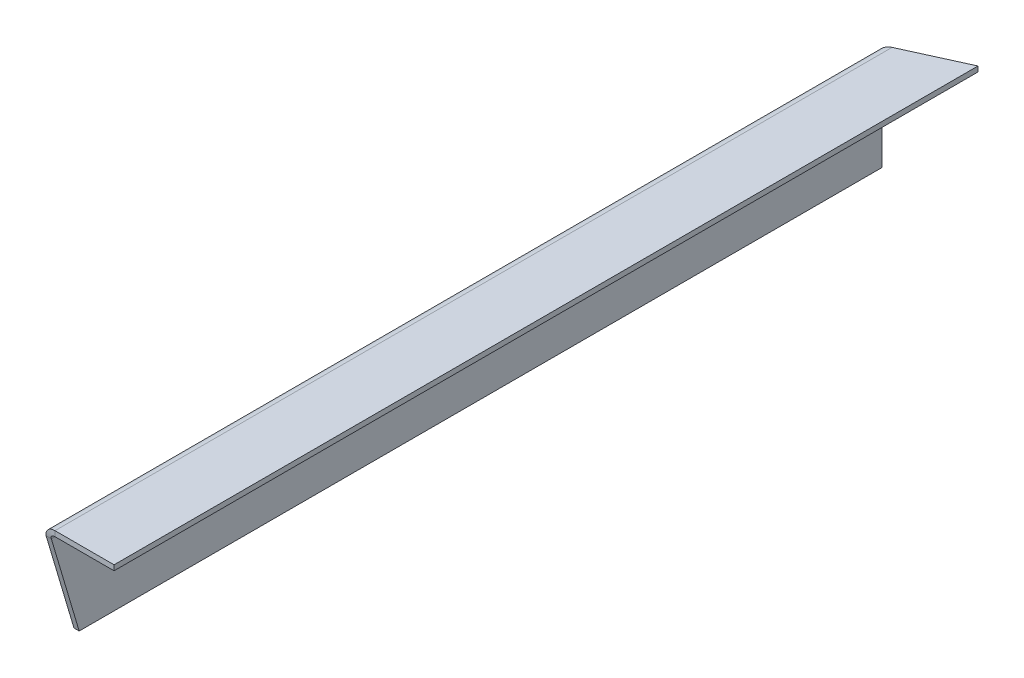
ISO-10303-21;
HEADER;
FILE_DESCRIPTION(('STEP AP214'),'2;1');
FILE_NAME('part.step','',(''),(''),'','','');
FILE_SCHEMA(('AUTOMOTIVE_DESIGN { 1 0 10303 214 1 1 1 1 }'));
ENDSEC;
DATA;
#1=APPLICATION_CONTEXT('core data for automotive mechanical design processes');
#2=APPLICATION_PROTOCOL_DEFINITION('international standard','automotive_design',2000,#1);
#3=PRODUCT_CONTEXT('',#1,'mechanical');
#4=PRODUCT('Part','Part','',(#3));
#5=PRODUCT_RELATED_PRODUCT_CATEGORY('part','',(#4));
#6=PRODUCT_DEFINITION_FORMATION('','',#4);
#7=PRODUCT_DEFINITION_CONTEXT('part definition',#1,'design');
#8=PRODUCT_DEFINITION('design','',#6,#7);
#9=PRODUCT_DEFINITION_SHAPE('','',#8);
#10=(LENGTH_UNIT() NAMED_UNIT(*) SI_UNIT(.MILLI.,.METRE.));
#11=(NAMED_UNIT(*) PLANE_ANGLE_UNIT() SI_UNIT($,.RADIAN.));
#12=(NAMED_UNIT(*) SI_UNIT($,.STERADIAN.) SOLID_ANGLE_UNIT());
#13=UNCERTAINTY_MEASURE_WITH_UNIT(LENGTH_MEASURE(1.E-05),#10,'distance_accuracy_value','');
#14=(GEOMETRIC_REPRESENTATION_CONTEXT(3) GLOBAL_UNCERTAINTY_ASSIGNED_CONTEXT((#13)) GLOBAL_UNIT_ASSIGNED_CONTEXT((#10,
#11,#12)) REPRESENTATION_CONTEXT('',''));
#15=CARTESIAN_POINT('',(0.,0.,0.));
#16=DIRECTION('',(0.,0.,1.));
#17=DIRECTION('',(1.,0.,0.));
#18=AXIS2_PLACEMENT_3D('',#15,#16,#17);
#19=CARTESIAN_POINT('',(0.,57.,436.000999999998));
#20=DIRECTION('',(0.,1.,0.));
#21=DIRECTION('',(0.,0.,1.));
#22=AXIS2_PLACEMENT_3D('',#19,#20,#21);
#23=PLANE('',#22);
#24=DIRECTION('',(-1.,0.,0.));
#25=VECTOR('',#24,1.);
#26=CARTESIAN_POINT('',(0.,57.,147.921874999998));
#27=LINE('',#26,#25);
#28=CARTESIAN_POINT('',(40.,57.,147.921874999998));
#29=VERTEX_POINT('',#28);
#30=CARTESIAN_POINT('',(6.,57.,147.921874999998));
#31=VERTEX_POINT('',#30);
#32=EDGE_CURVE('E196',#29,#31,#27,.T.);
#33=ORIENTED_EDGE('',*,*,#32,.T.);
#34=DIRECTION('',(0.,0.,-1.));
#35=VECTOR('',#34,1.);
#36=CARTESIAN_POINT('',(6.,57.,436.000999999998));
#37=LINE('',#36,#35);
#38=CARTESIAN_POINT('',(6.00000000000378,57.,-333.839611602809));
#39=VERTEX_POINT('',#38);
#40=EDGE_CURVE('E119',#31,#39,#37,.T.);
#41=ORIENTED_EDGE('',*,*,#40,.T.);
#42=CARTESIAN_POINT('',(7055.93060017359,57.,15135.4356956873));
#43=DIRECTION('',(0.,-1.,0.));
#44=DIRECTION('',(0.,0.,-1.));
#45=AXIS2_PLACEMENT_3D('',#42,#43,#44);
#46=CIRCLE('',#45,17000.);
#47=CARTESIAN_POINT('',(40.,57.,-349.289610676623));
#48=VERTEX_POINT('',#47);
#49=EDGE_CURVE('E135',#48,#39,#46,.F.);
#50=ORIENTED_EDGE('',*,*,#49,.F.);
#51=DIRECTION('',(0.,0.,-1.));
#52=VECTOR('',#51,1.);
#53=CARTESIAN_POINT('',(40.,57.,436.000999999998));
#54=LINE('',#53,#52);
#55=EDGE_CURVE('E11',#29,#48,#54,.T.);
#56=ORIENTED_EDGE('',*,*,#55,.F.);
#57=EDGE_LOOP('',(#33,#41,#50,#56));
#58=FACE_BOUND('',#57,.T.);
#59=ADVANCED_FACE('F39',(#58),#23,.F.);
#60=CARTESIAN_POINT('',(40.,60.,436.000999999998));
#61=DIRECTION('',(1.,0.,0.));
#62=DIRECTION('',(0.,0.,-1.));
#63=AXIS2_PLACEMENT_3D('',#60,#61,#62);
#64=PLANE('',#63);
#65=DIRECTION('',(0.,0.,-1.));
#66=VECTOR('',#65,1.);
#67=CARTESIAN_POINT('',(40.,60.,436.000999999998));
#68=LINE('',#67,#66);
#69=CARTESIAN_POINT('',(40.,60.,147.921874999998));
#70=VERTEX_POINT('',#69);
#71=CARTESIAN_POINT('',(40.,60.,-349.289610676624));
#72=VERTEX_POINT('',#71);
#73=EDGE_CURVE('E47',#70,#72,#68,.T.);
#74=ORIENTED_EDGE('',*,*,#73,.F.);
#75=DIRECTION('',(0.,-1.,0.));
#76=VECTOR('',#75,1.);
#77=CARTESIAN_POINT('',(40.,57.,147.921874999998));
#78=LINE('',#77,#76);
#79=EDGE_CURVE('E199',#29,#70,#78,.F.);
#80=ORIENTED_EDGE('',*,*,#79,.F.);
#81=ORIENTED_EDGE('',*,*,#55,.T.);
#82=DIRECTION('',(0.,-1.,0.));
#83=VECTOR('',#82,1.);
#84=CARTESIAN_POINT('',(40.,57.,-349.289610676623));
#85=LINE('',#84,#83);
#86=EDGE_CURVE('E251',#48,#72,#85,.F.);
#87=ORIENTED_EDGE('',*,*,#86,.T.);
#88=EDGE_LOOP('',(#74,#80,#81,#87));
#89=FACE_BOUND('',#88,.T.);
#90=ADVANCED_FACE('F238',(#89),#64,.T.);
#91=CARTESIAN_POINT('',(0.,60.,436.000999999998));
#92=DIRECTION('',(0.,1.,0.));
#93=DIRECTION('',(0.,0.,1.));
#94=AXIS2_PLACEMENT_3D('',#91,#92,#93);
#95=PLANE('',#94);
#96=DIRECTION('',(0.,0.,-1.));
#97=VECTOR('',#96,1.);
#98=CARTESIAN_POINT('',(6.,60.,436.000999999998));
#99=LINE('',#98,#97);
#100=CARTESIAN_POINT('',(6.,60.,147.921874999998));
#101=VERTEX_POINT('',#100);
#102=CARTESIAN_POINT('',(6.00000000000378,60.,-333.839611602809));
#103=VERTEX_POINT('',#102);
#104=EDGE_CURVE('E215',#101,#103,#99,.T.);
#105=ORIENTED_EDGE('',*,*,#104,.F.);
#106=DIRECTION('',(1.,0.,0.));
#107=VECTOR('',#106,1.);
#108=CARTESIAN_POINT('',(0.,60.,147.921874999998));
#109=LINE('',#108,#107);
#110=EDGE_CURVE('E78',#70,#101,#109,.F.);
#111=ORIENTED_EDGE('',*,*,#110,.F.);
#112=ORIENTED_EDGE('',*,*,#73,.T.);
#113=CARTESIAN_POINT('',(7055.93060017359,60.,15135.4356956873));
#114=DIRECTION('',(0.,-1.,0.));
#115=DIRECTION('',(0.,0.,-1.));
#116=AXIS2_PLACEMENT_3D('',#113,#114,#115);
#117=CIRCLE('',#116,17000.);
#118=EDGE_CURVE('E255',#72,#103,#117,.F.);
#119=ORIENTED_EDGE('',*,*,#118,.T.);
#120=EDGE_LOOP('',(#105,#111,#112,#119));
#121=FACE_BOUND('',#120,.T.);
#122=ADVANCED_FACE('F235',(#121),#95,.T.);
#123=CARTESIAN_POINT('',(6.,54.,436.000999999998));
#124=DIRECTION('',(0.,0.,-1.));
#125=DIRECTION('',(-1.,0.,0.));
#126=AXIS2_PLACEMENT_3D('',#123,#124,#125);
#127=CYLINDRICAL_SURFACE('',#126,6.);
#128=DIRECTION('',(0.,0.,-1.));
#129=VECTOR('',#128,1.);
#130=CARTESIAN_POINT('',(0.,54.,436.000999999998));
#131=LINE('',#130,#129);
#132=CARTESIAN_POINT('',(0.,54.,147.031249999998));
#133=VERTEX_POINT('',#132);
#134=CARTESIAN_POINT('',(0.,54.,-331.103780405389));
#135=VERTEX_POINT('',#134);
#136=EDGE_CURVE('E214',#133,#135,#131,.T.);
#137=ORIENTED_EDGE('',*,*,#136,.F.);
#138=CARTESIAN_POINT('',(6.,54.,147.031249999998));
#139=DIRECTION('',(0.,0.146828724135003,-0.989161931014779));
#140=DIRECTION('',(0.,-0.989161931014779,-0.146828724135003));
#141=AXIS2_PLACEMENT_3D('',#138,#139,#140);
#142=ELLIPSE('',#141,6.06574091852141,6.);
#143=EDGE_CURVE('E194',#101,#133,#142,.F.);
#144=ORIENTED_EDGE('',*,*,#143,.F.);
#145=ORIENTED_EDGE('',*,*,#104,.T.);
#146=CARTESIAN_POINT('',(0.,54.,-331.10378040539));
#147=CARTESIAN_POINT('',(0.,54.4160371950527,-331.10378040539));
#148=CARTESIAN_POINT('',(0.0442351334064377,54.8349066872946,-331.123960948243));
#149=CARTESIAN_POINT('',(0.21323954592697,55.6375615316122,-331.201060103001));
#150=CARTESIAN_POINT('',(0.337216393784221,56.0243977100815,-331.257617191109));
#151=CARTESIAN_POINT('',(0.580869035387985,56.583475498865,-331.368763518113));
#152=CARTESIAN_POINT('',(0.672417257363519,56.767232320977,-331.410524024936));
#153=CARTESIAN_POINT('',(0.870361556746827,57.1188975679552,-331.500815507175));
#154=CARTESIAN_POINT('',(0.977019537102044,57.2876946774491,-331.54946596417));
#155=CARTESIAN_POINT('',(1.31883555582901,57.7740926774201,-331.705375410735));
#156=CARTESIAN_POINT('',(1.57563690181756,58.0718821738655,-331.822501886966));
#157=CARTESIAN_POINT('',(2.1460633146469,58.6154507133856,-332.082651023496));
#158=CARTESIAN_POINT('',(2.45396165550428,58.8550818889665,-332.223061717152));
#159=CARTESIAN_POINT('',(3.09896064946205,59.2659451930148,-332.517174364976));
#160=CARTESIAN_POINT('',(3.43799966659085,59.4389671081319,-332.67176038214));
#161=CARTESIAN_POINT('',(4.50473923725685,59.8608046289157,-333.158097498544));
#162=CARTESIAN_POINT('',(5.24514262355826,60.,-333.495594704074));
#163=CARTESIAN_POINT('',(6.,60.,-333.839611602812));
#164=B_SPLINE_CURVE_WITH_KNOTS('',3,(#146,#147,#148,#149,#150,#151,#152,#153,#154,#155,#156,
#157,#158,#159,#160,#161,#162,#163),.UNSPECIFIED.,.F.,.F.,(4,2,2,2,2,2,2,2,4),(0.,
0.00123055300962421,0.00246110601924649,0.00307638252405763,0.00369165902886877,
0.00492221203849105,0.00615276504811334,0.00738331805773562,0.00984442407698018),.UNSPECIFIED.);
#165=EDGE_CURVE('E136',#103,#135,#164,.F.);
#166=ORIENTED_EDGE('',*,*,#165,.T.);
#167=EDGE_LOOP('',(#137,#144,#145,#166));
#168=FACE_BOUND('',#167,.T.);
#169=ADVANCED_FACE('F224',(#168),#127,.T.);
#170=CARTESIAN_POINT('',(0.,0.,436.000999999998));
#171=DIRECTION('',(-1.,0.,0.));
#172=DIRECTION('',(0.,0.,1.));
#173=AXIS2_PLACEMENT_3D('',#170,#171,#172);
#174=PLANE('',#173);
#175=DIRECTION('',(0.,0.,-1.));
#176=VECTOR('',#175,1.);
#177=CARTESIAN_POINT('',(0.,0.,436.000999999998));
#178=LINE('',#177,#176);
#179=CARTESIAN_POINT('',(0.,0.,130.999999999998));
#180=VERTEX_POINT('',#179);
#181=CARTESIAN_POINT('',(1.77635683940025E-12,0.,-331.103780405385));
#182=VERTEX_POINT('',#181);
#183=EDGE_CURVE('E212',#180,#182,#178,.T.);
#184=ORIENTED_EDGE('',*,*,#183,.F.);
#185=DIRECTION('',(0.,-0.958646866278097,-0.28459828842631));
#186=VECTOR('',#185,1.);
#187=CARTESIAN_POINT('',(0.,83.2131963203949,155.703917657615));
#188=LINE('',#187,#186);
#189=EDGE_CURVE('E204',#133,#180,#188,.T.);
#190=ORIENTED_EDGE('',*,*,#189,.F.);
#191=ORIENTED_EDGE('',*,*,#136,.T.);
#192=DIRECTION('',(0.,1.,0.));
#193=VECTOR('',#192,1.);
#194=CARTESIAN_POINT('',(1.77635683940025E-12,0.,-331.103780405385));
#195=LINE('',#194,#193);
#196=EDGE_CURVE('E147',#135,#182,#195,.F.);
#197=ORIENTED_EDGE('',*,*,#196,.T.);
#198=EDGE_LOOP('',(#184,#190,#191,#197));
#199=FACE_BOUND('',#198,.T.);
#200=ADVANCED_FACE('F234',(#199),#174,.T.);
#201=CARTESIAN_POINT('',(3.,0.,436.000999999998));
#202=DIRECTION('',(0.,-1.,0.));
#203=DIRECTION('',(0.,0.,-1.));
#204=AXIS2_PLACEMENT_3D('',#201,#202,#203);
#205=PLANE('',#204);
#206=DIRECTION('',(0.,0.,-1.));
#207=VECTOR('',#206,1.);
#208=CARTESIAN_POINT('',(3.,0.,436.000999999998));
#209=LINE('',#208,#207);
#210=CARTESIAN_POINT('',(3.,0.,130.999999999998));
#211=VERTEX_POINT('',#210);
#212=CARTESIAN_POINT('',(3.,0.,-331.103780405385));
#213=VERTEX_POINT('',#212);
#214=EDGE_CURVE('E118',#211,#213,#209,.T.);
#215=ORIENTED_EDGE('',*,*,#214,.F.);
#216=DIRECTION('',(-1.,0.,0.));
#217=VECTOR('',#216,1.);
#218=CARTESIAN_POINT('',(0.,0.,130.999999999998));
#219=LINE('',#218,#217);
#220=EDGE_CURVE('E63',#180,#211,#219,.F.);
#221=ORIENTED_EDGE('',*,*,#220,.F.);
#222=ORIENTED_EDGE('',*,*,#183,.T.);
#223=DIRECTION('',(-1.,0.,0.));
#224=VECTOR('',#223,1.);
#225=CARTESIAN_POINT('',(1.77635683940025E-12,0.,-331.103780405385));
#226=LINE('',#225,#224);
#227=EDGE_CURVE('E148',#182,#213,#226,.F.);
#228=ORIENTED_EDGE('',*,*,#227,.T.);
#229=EDGE_LOOP('',(#215,#221,#222,#228));
#230=FACE_BOUND('',#229,.T.);
#231=ADVANCED_FACE('F318',(#230),#205,.T.);
#232=CARTESIAN_POINT('',(3.,0.,436.000999999998));
#233=DIRECTION('',(-1.,0.,0.));
#234=DIRECTION('',(0.,0.,1.));
#235=AXIS2_PLACEMENT_3D('',#232,#233,#234);
#236=PLANE('',#235);
#237=DIRECTION('',(0.,-0.958646866278097,-0.28459828842631));
#238=VECTOR('',#237,1.);
#239=CARTESIAN_POINT('',(3.,83.2131963203949,155.703917657615));
#240=LINE('',#239,#238);
#241=CARTESIAN_POINT('',(3.,54.,147.031249999998));
#242=VERTEX_POINT('',#241);
#243=EDGE_CURVE('E206',#242,#211,#240,.T.);
#244=ORIENTED_EDGE('',*,*,#243,.T.);
#245=ORIENTED_EDGE('',*,*,#214,.T.);
#246=DIRECTION('',(0.,1.,0.));
#247=VECTOR('',#246,1.);
#248=CARTESIAN_POINT('',(3.,0.,-331.103780405389));
#249=LINE('',#248,#247);
#250=CARTESIAN_POINT('',(3.,54.,-331.103780405389));
#251=VERTEX_POINT('',#250);
#252=EDGE_CURVE('E144',#251,#213,#249,.F.);
#253=ORIENTED_EDGE('',*,*,#252,.F.);
#254=DIRECTION('',(0.,0.,-1.));
#255=VECTOR('',#254,1.);
#256=CARTESIAN_POINT('',(3.,54.,436.000999999998));
#257=LINE('',#256,#255);
#258=EDGE_CURVE('E109',#242,#251,#257,.T.);
#259=ORIENTED_EDGE('',*,*,#258,.F.);
#260=EDGE_LOOP('',(#244,#245,#253,#259));
#261=FACE_BOUND('',#260,.T.);
#262=ADVANCED_FACE('F151',(#261),#236,.F.);
#263=CARTESIAN_POINT('',(6.,54.,436.000999999998));
#264=DIRECTION('',(0.,0.,-1.));
#265=DIRECTION('',(-1.,0.,0.));
#266=AXIS2_PLACEMENT_3D('',#263,#264,#265);
#267=CYLINDRICAL_SURFACE('',#266,3.);
#268=CARTESIAN_POINT('',(6.,54.,147.031249999998));
#269=DIRECTION('',(0.,0.28459828842631,-0.958646866278097));
#270=DIRECTION('',(0.,-0.958646866278097,-0.28459828842631));
#271=AXIS2_PLACEMENT_3D('',#268,#269,#270);
#272=ELLIPSE('',#271,3.12941094946397,3.);
#273=EDGE_CURVE('E115',#31,#242,#272,.F.);
#274=ORIENTED_EDGE('',*,*,#273,.T.);
#275=ORIENTED_EDGE('',*,*,#258,.T.);
#276=CARTESIAN_POINT('',(6.,57.,-333.839611602812));
#277=CARTESIAN_POINT('',(5.62257141705584,57.,-333.495594800031));
#278=CARTESIAN_POINT('',(5.25236961862842,56.9304023144578,-333.158097498544));
#279=CARTESIAN_POINT('',(4.71899983329543,56.7194835540659,-332.67176038214));
#280=CARTESIAN_POINT('',(4.54948032473102,56.6329725965074,-332.517174364976));
#281=CARTESIAN_POINT('',(4.22698082775214,56.4275409444833,-332.223061717152));
#282=CARTESIAN_POINT('',(4.07303165732344,56.3077253566928,-332.082651023496));
#283=CARTESIAN_POINT('',(3.78781845090878,56.0359410869328,-331.822501886966));
#284=CARTESIAN_POINT('',(3.6594177779145,55.88704633871,-331.705375410735));
#285=CARTESIAN_POINT('',(3.48850976855102,55.6438473387245,-331.54946596417));
#286=CARTESIAN_POINT('',(3.43518077837341,55.5594487839776,-331.500815507175));
#287=CARTESIAN_POINT('',(3.33620862868176,55.3836161604885,-331.410524024936));
#288=CARTESIAN_POINT('',(3.29043451769399,55.2917377494325,-331.368763518113));
#289=CARTESIAN_POINT('',(3.16860819689211,55.0121988550408,-331.257617191109));
#290=CARTESIAN_POINT('',(3.10661977296348,54.8187807658061,-331.201060103001));
#291=CARTESIAN_POINT('',(3.02211756670322,54.4174533436473,-331.123960948243));
#292=CARTESIAN_POINT('',(2.99999999999997,54.2080185975264,-331.10378040539));
#293=CARTESIAN_POINT('',(2.99999999999997,54.,-331.10378040539));
#294=B_SPLINE_CURVE_WITH_KNOTS('',3,(#276,#277,#278,#279,#280,#281,#282,#283,#284,#285,#286,
#287,#288,#289,#290,#291,#292,#293),.UNSPECIFIED.,.F.,.F.,(4,2,2,2,2,2,2,2,4),(0.,
0.00246110601924649,0.00369165902886877,0.00492221203849105,0.00615276504811334,
0.00676804155292448,0.00738331805773562,0.0086138710673579,0.00984442407698018),.UNSPECIFIED.);
#295=EDGE_CURVE('E113',#39,#251,#294,.T.);
#296=ORIENTED_EDGE('',*,*,#295,.F.);
#297=ORIENTED_EDGE('',*,*,#40,.F.);
#298=EDGE_LOOP('',(#274,#275,#296,#297));
#299=FACE_BOUND('',#298,.T.);
#300=ADVANCED_FACE('F111',(#299),#267,.F.);
#301=CARTESIAN_POINT('',(0.,83.2131963203949,155.703917657615));
#302=DIRECTION('',(0.,0.28459828842631,-0.958646866278097));
#303=DIRECTION('',(0.,-0.958646866278097,-0.28459828842631));
#304=AXIS2_PLACEMENT_3D('',#301,#302,#303);
#305=PLANE('',#304);
#306=ORIENTED_EDGE('',*,*,#189,.T.);
#307=ORIENTED_EDGE('',*,*,#220,.T.);
#308=ORIENTED_EDGE('',*,*,#243,.F.);
#309=DIRECTION('',(-1.,0.,0.));
#310=VECTOR('',#309,1.);
#311=CARTESIAN_POINT('',(0.,54.,147.031249999998));
#312=LINE('',#311,#310);
#313=EDGE_CURVE('E55',#133,#242,#312,.F.);
#314=ORIENTED_EDGE('',*,*,#313,.F.);
#315=EDGE_LOOP('',(#306,#307,#308,#314));
#316=FACE_BOUND('',#315,.T.);
#317=ADVANCED_FACE('F316',(#316),#305,.F.);
#318=CARTESIAN_POINT('',(0.,57.,147.921874999998));
#319=DIRECTION('',(0.,0.,-1.));
#320=DIRECTION('',(-1.,0.,0.));
#321=AXIS2_PLACEMENT_3D('',#318,#319,#320);
#322=PLANE('',#321);
#323=DIRECTION('',(0.,-1.,0.));
#324=VECTOR('',#323,1.);
#325=CARTESIAN_POINT('',(6.,57.,147.921874999998));
#326=LINE('',#325,#324);
#327=EDGE_CURVE('E202',#31,#101,#326,.F.);
#328=ORIENTED_EDGE('',*,*,#327,.F.);
#329=ORIENTED_EDGE('',*,*,#32,.F.);
#330=ORIENTED_EDGE('',*,*,#79,.T.);
#331=ORIENTED_EDGE('',*,*,#110,.T.);
#332=EDGE_LOOP('',(#328,#329,#330,#331));
#333=FACE_BOUND('',#332,.T.);
#334=ADVANCED_FACE('F328',(#333),#322,.F.);
#335=CARTESIAN_POINT('',(6.,48.,146.140624999998));
#336=CARTESIAN_POINT('',(6.,49.,146.140624999998));
#337=CARTESIAN_POINT('',(6.,50.,146.140624999998));
#338=CARTESIAN_POINT('',(6.,51.,146.140624999998));
#339=CARTESIAN_POINT('',(18.,48.,146.140624999998));
#340=CARTESIAN_POINT('',(16.,49.,146.140624999998));
#341=CARTESIAN_POINT('',(14.,50.,146.140624999998));
#342=CARTESIAN_POINT('',(12.,51.,146.140624999998));
#343=CARTESIAN_POINT('',(18.,60.,147.921874999998));
#344=CARTESIAN_POINT('',(16.,59.,147.921874999998));
#345=CARTESIAN_POINT('',(14.,58.,147.921874999998));
#346=CARTESIAN_POINT('',(12.,57.,147.921874999998));
#347=CARTESIAN_POINT('',(6.,60.,147.921874999998));
#348=CARTESIAN_POINT('',(6.,59.,147.921874999998));
#349=CARTESIAN_POINT('',(6.,58.,147.921874999998));
#350=CARTESIAN_POINT('',(6.,57.,147.921874999998));
#351=CARTESIAN_POINT('',(-6.,60.,147.921874999998));
#352=CARTESIAN_POINT('',(-4.,59.,147.921874999998));
#353=CARTESIAN_POINT('',(-2.,58.,147.921874999998));
#354=CARTESIAN_POINT('',(0.,57.,147.921874999998));
#355=CARTESIAN_POINT('',(-6.,48.,146.140624999998));
#356=CARTESIAN_POINT('',(-4.,49.,146.140624999998));
#357=CARTESIAN_POINT('',(-2.,50.,146.140624999998));
#358=CARTESIAN_POINT('',(0.,51.,146.140624999998));
#359=CARTESIAN_POINT('',(6.,48.,146.140624999998));
#360=CARTESIAN_POINT('',(6.,49.,146.140624999998));
#361=CARTESIAN_POINT('',(6.,50.,146.140624999998));
#362=CARTESIAN_POINT('',(6.,51.,146.140624999998));
#363=(BOUNDED_SURFACE() B_SPLINE_SURFACE(3,3,((#335,#336,#337,#338),(#339,#340,#341,#342),(#343,
#344,#345,#346),(#347,#348,#349,#350),(#351,#352,#353,#354),(#355,#356,#357,#358),(#359,#360,
#361,#362)),.UNSPECIFIED.,.T.,.F.,.F.) B_SPLINE_SURFACE_WITH_KNOTS((4,3,4),(4,4),(0.,0.5,1.),
(0.,1.),.UNSPECIFIED.) GEOMETRIC_REPRESENTATION_ITEM() RATIONAL_B_SPLINE_SURFACE(((1.,1.,1.,1.),
(0.333333333333333,0.333333333333333,0.333333333333333,0.333333333333333),(0.333333333333333,
0.333333333333333,0.333333333333333,0.333333333333333),(1.,1.,1.,1.),(0.333333333333333,
0.333333333333333,0.333333333333333,0.333333333333333),(0.333333333333333,0.333333333333333,
0.333333333333333,0.333333333333333),(1.,1.,1.,1.))) REPRESENTATION_ITEM('') SURFACE());
#364=ORIENTED_EDGE('',*,*,#313,.T.);
#365=ORIENTED_EDGE('',*,*,#273,.F.);
#366=ORIENTED_EDGE('',*,*,#327,.T.);
#367=ORIENTED_EDGE('',*,*,#143,.T.);
#368=EDGE_LOOP('',(#364,#365,#366,#367));
#369=FACE_BOUND('',#368,.T.);
#370=ADVANCED_FACE('F180',(#369),#363,.T.);
#371=CARTESIAN_POINT('',(1.77635683940025E-12,0.,-331.103780405385));
#372=DIRECTION('',(0.,0.,-1.));
#373=DIRECTION('',(0.,1.,0.));
#374=AXIS2_PLACEMENT_3D('',#371,#372,#373);
#375=PLANE('',#374);
#376=ORIENTED_EDGE('',*,*,#227,.F.);
#377=ORIENTED_EDGE('',*,*,#196,.F.);
#378=CARTESIAN_POINT('',(2.99999999999997,54.,-331.10378040539));
#379=CARTESIAN_POINT('',(0.,54.,-331.10378040539));
#380=B_SPLINE_CURVE_WITH_KNOTS('',1,(#378,#379),.UNSPECIFIED.,.F.,.F.,(2,2),(0.,1.),.UNSPECIFIED.);
#381=EDGE_CURVE('E128',#135,#251,#380,.F.);
#382=ORIENTED_EDGE('',*,*,#381,.T.);
#383=ORIENTED_EDGE('',*,*,#252,.T.);
#384=EDGE_LOOP('',(#376,#377,#382,#383));
#385=FACE_BOUND('',#384,.T.);
#386=ADVANCED_FACE('F143',(#385),#375,.T.);
#387=CARTESIAN_POINT('',(7055.93060017359,57.,15135.4356956873));
#388=DIRECTION('',(0.,-1.,0.));
#389=DIRECTION('',(0.,0.,-1.));
#390=AXIS2_PLACEMENT_3D('',#387,#388,#389);
#391=CYLINDRICAL_SURFACE('',#390,17000.);
#392=ORIENTED_EDGE('',*,*,#49,.T.);
#393=CARTESIAN_POINT('',(6.,60.,-333.839611602812));
#394=CARTESIAN_POINT('',(6.,57.,-333.839611602812));
#395=B_SPLINE_CURVE_WITH_KNOTS('',1,(#393,#394),.UNSPECIFIED.,.F.,.F.,(2,2),(0.,1.),.UNSPECIFIED.);
#396=EDGE_CURVE('E132',#39,#103,#395,.F.);
#397=ORIENTED_EDGE('',*,*,#396,.T.);
#398=ORIENTED_EDGE('',*,*,#118,.F.);
#399=ORIENTED_EDGE('',*,*,#86,.F.);
#400=EDGE_LOOP('',(#392,#397,#398,#399));
#401=FACE_BOUND('',#400,.T.);
#402=ADVANCED_FACE('F163',(#401),#391,.T.);
#403=CARTESIAN_POINT('',(6.,57.,-333.839611602812));
#404=CARTESIAN_POINT('',(5.62257141705584,57.,-333.495594800031));
#405=CARTESIAN_POINT('',(5.25236961862842,56.9304023144578,-333.158097498544));
#406=CARTESIAN_POINT('',(4.71899983329543,56.7194835540659,-332.67176038214));
#407=CARTESIAN_POINT('',(4.54948032473102,56.6329725965074,-332.517174364976));
#408=CARTESIAN_POINT('',(4.22698082775214,56.4275409444833,-332.223061717152));
#409=CARTESIAN_POINT('',(4.07303165732344,56.3077253566928,-332.082651023496));
#410=CARTESIAN_POINT('',(3.78781845090878,56.0359410869328,-331.822501886966));
#411=CARTESIAN_POINT('',(3.6594177779145,55.88704633871,-331.705375410735));
#412=CARTESIAN_POINT('',(3.48850976855102,55.6438473387245,-331.54946596417));
#413=CARTESIAN_POINT('',(3.43518077837341,55.5594487839776,-331.500815507175));
#414=CARTESIAN_POINT('',(3.33620862868176,55.3836161604885,-331.410524024936));
#415=CARTESIAN_POINT('',(3.29043451769399,55.2917377494325,-331.368763518113));
#416=CARTESIAN_POINT('',(3.16860819689211,55.0121988550408,-331.257617191109));
#417=CARTESIAN_POINT('',(3.10661977296348,54.8187807658061,-331.201060103001));
#418=CARTESIAN_POINT('',(3.02211756670322,54.4174533436473,-331.123960948243));
#419=CARTESIAN_POINT('',(2.99999999999997,54.2080185975264,-331.10378040539));
#420=CARTESIAN_POINT('',(2.99999999999997,54.,-331.10378040539));
#421=CARTESIAN_POINT('',(6.,60.,-333.839611602812));
#422=CARTESIAN_POINT('',(5.24514262355826,60.,-333.495594704074));
#423=CARTESIAN_POINT('',(4.50473923725685,59.8608046289157,-333.158097498544));
#424=CARTESIAN_POINT('',(3.43799966659085,59.4389671081319,-332.67176038214));
#425=CARTESIAN_POINT('',(3.09896064946205,59.2659451930148,-332.517174364976));
#426=CARTESIAN_POINT('',(2.45396165550428,58.8550818889665,-332.223061717152));
#427=CARTESIAN_POINT('',(2.1460633146469,58.6154507133856,-332.082651023496));
#428=CARTESIAN_POINT('',(1.57563690181756,58.0718821738655,-331.822501886966));
#429=CARTESIAN_POINT('',(1.31883555582901,57.7740926774201,-331.705375410735));
#430=CARTESIAN_POINT('',(0.977019537102044,57.2876946774491,-331.54946596417));
#431=CARTESIAN_POINT('',(0.870361556746827,57.1188975679552,-331.500815507175));
#432=CARTESIAN_POINT('',(0.672417257363519,56.767232320977,-331.410524024936));
#433=CARTESIAN_POINT('',(0.580869035387985,56.583475498865,-331.368763518113));
#434=CARTESIAN_POINT('',(0.337216393784221,56.0243977100815,-331.257617191109));
#435=CARTESIAN_POINT('',(0.21323954592697,55.6375615316122,-331.201060103001));
#436=CARTESIAN_POINT('',(0.0442351334064377,54.8349066872946,-331.123960948243));
#437=CARTESIAN_POINT('',(0.,54.4160371950527,-331.10378040539));
#438=CARTESIAN_POINT('',(0.,54.,-331.10378040539));
#439=B_SPLINE_SURFACE_WITH_KNOTS('',1,3,((#403,#404,#405,#406,#407,#408,#409,#410,#411,#412,
#413,#414,#415,#416,#417,#418,#419,#420),(#421,#422,#423,#424,#425,#426,#427,#428,#429,#430,
#431,#432,#433,#434,#435,#436,#437,#438)),.UNSPECIFIED.,.F.,.F.,.F.,(2,2),(4,2,2,2,2,2,2,2,4),
(0.,1.),(0.,0.00246110601924649,0.00369165902886877,0.00492221203849105,0.00615276504811334,
0.00676804155292448,0.00738331805773562,0.0086138710673579,0.00984442407698018),.UNSPECIFIED.);
#440=ORIENTED_EDGE('',*,*,#381,.F.);
#441=ORIENTED_EDGE('',*,*,#165,.F.);
#442=ORIENTED_EDGE('',*,*,#396,.F.);
#443=ORIENTED_EDGE('',*,*,#295,.T.);
#444=EDGE_LOOP('',(#440,#441,#442,#443));
#445=FACE_BOUND('',#444,.T.);
#446=ADVANCED_FACE('F126',(#445),#439,.F.);
#447=CLOSED_SHELL('',(#59,#90,#122,#169,#200,#231,#262,#300,#317,#334,#370,#386,#402,#446));
#448=MANIFOLD_SOLID_BREP('B2',#447);
#449=ADVANCED_BREP_SHAPE_REPRESENTATION('',(#18,#448),#14);
#450=SHAPE_DEFINITION_REPRESENTATION(#9,#449);
ENDSEC;
END-ISO-10303-21;
